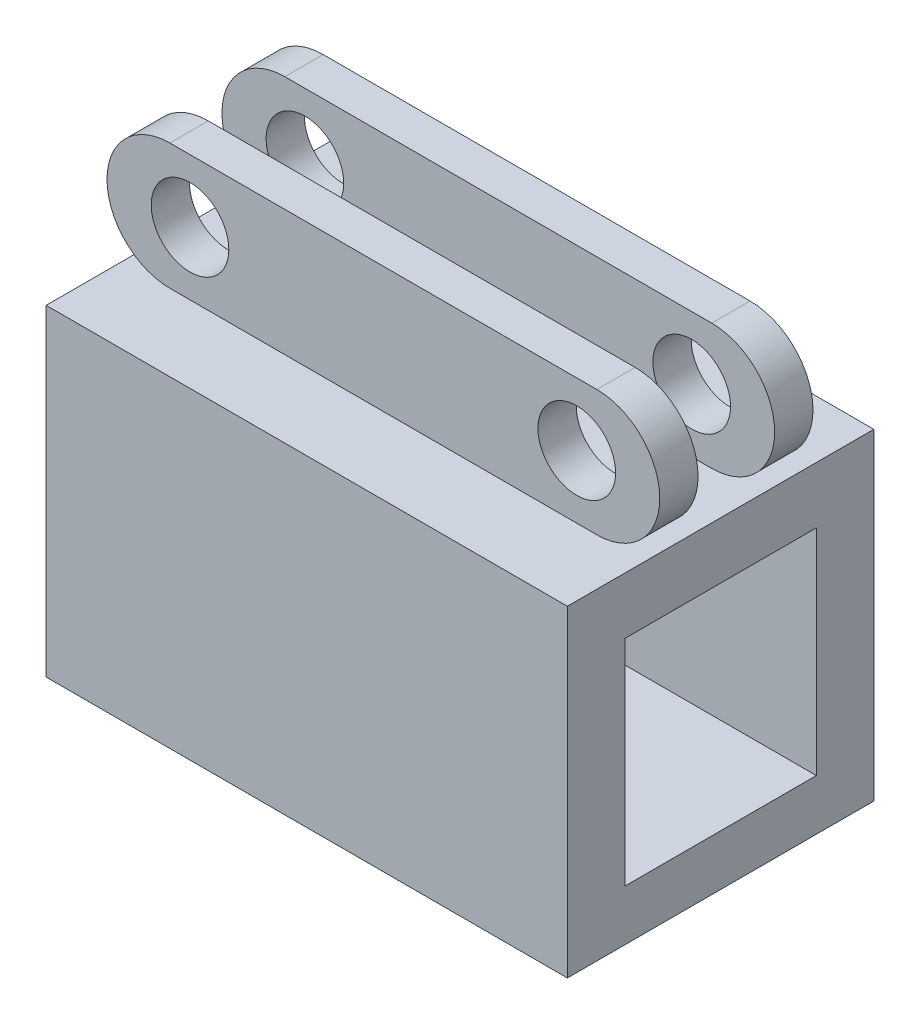
ISO-10303-21;
HEADER;
FILE_DESCRIPTION(('STEP AP214'),'2;1');
FILE_NAME('part.step','',(''),(''),'','','');
FILE_SCHEMA(('AUTOMOTIVE_DESIGN { 1 0 10303 214 1 1 1 1 }'));
ENDSEC;
DATA;
#1=APPLICATION_CONTEXT('core data for automotive mechanical design processes');
#2=APPLICATION_PROTOCOL_DEFINITION('international standard','automotive_design',2000,#1);
#3=PRODUCT_CONTEXT('',#1,'mechanical');
#4=PRODUCT('Part','Part','',(#3));
#5=PRODUCT_RELATED_PRODUCT_CATEGORY('part','',(#4));
#6=PRODUCT_DEFINITION_FORMATION('','',#4);
#7=PRODUCT_DEFINITION_CONTEXT('part definition',#1,'design');
#8=PRODUCT_DEFINITION('design','',#6,#7);
#9=PRODUCT_DEFINITION_SHAPE('','',#8);
#10=(LENGTH_UNIT() NAMED_UNIT(*) SI_UNIT(.MILLI.,.METRE.));
#11=(NAMED_UNIT(*) PLANE_ANGLE_UNIT() SI_UNIT($,.RADIAN.));
#12=(NAMED_UNIT(*) SI_UNIT($,.STERADIAN.) SOLID_ANGLE_UNIT());
#13=UNCERTAINTY_MEASURE_WITH_UNIT(LENGTH_MEASURE(1.E-05),#10,'distance_accuracy_value','');
#14=(GEOMETRIC_REPRESENTATION_CONTEXT(3) GLOBAL_UNCERTAINTY_ASSIGNED_CONTEXT((#13)) GLOBAL_UNIT_ASSIGNED_CONTEXT((#10,
#11,#12)) REPRESENTATION_CONTEXT('',''));
#15=CARTESIAN_POINT('',(0.,0.,0.));
#16=DIRECTION('',(0.,0.,1.));
#17=DIRECTION('',(1.,0.,0.));
#18=AXIS2_PLACEMENT_3D('',#15,#16,#17);
#19=CARTESIAN_POINT('',(-27.8600196417873,0.,10.));
#20=DIRECTION('',(0.,0.,-1.));
#21=DIRECTION('',(-1.,0.,0.));
#22=AXIS2_PLACEMENT_3D('',#19,#20,#21);
#23=CYLINDRICAL_SURFACE('',#22,8.21121810957072);
#24=CARTESIAN_POINT('',(-27.8600196417873,0.,5.));
#25=DIRECTION('',(0.,0.,-1.));
#26=DIRECTION('',(-1.,0.,0.));
#27=AXIS2_PLACEMENT_3D('',#24,#25,#26);
#28=CIRCLE('',#27,8.21121810957072);
#29=CARTESIAN_POINT('',(-27.8600196417873,-8.21121810957072,5.));
#30=VERTEX_POINT('',#29);
#31=CARTESIAN_POINT('',(-27.8600196417873,8.21121810957072,5.));
#32=VERTEX_POINT('',#31);
#33=EDGE_CURVE('E49',#30,#32,#28,.T.);
#34=ORIENTED_EDGE('',*,*,#33,.F.);
#35=DIRECTION('',(0.,0.,-1.));
#36=VECTOR('',#35,1.);
#37=CARTESIAN_POINT('',(-27.8600196417873,-8.21121810957072,10.));
#38=LINE('',#37,#36);
#39=CARTESIAN_POINT('',(-27.8600196417873,-8.21121810957072,10.));
#40=VERTEX_POINT('',#39);
#41=EDGE_CURVE('E160',#40,#30,#38,.T.);
#42=ORIENTED_EDGE('',*,*,#41,.F.);
#43=CARTESIAN_POINT('',(-27.8600196417873,0.,10.));
#44=DIRECTION('',(0.,0.,1.));
#45=DIRECTION('',(1.,0.,0.));
#46=AXIS2_PLACEMENT_3D('',#43,#44,#45);
#47=CIRCLE('',#46,8.21121810957072);
#48=CARTESIAN_POINT('',(-27.8600196417873,8.21121810957072,10.));
#49=VERTEX_POINT('',#48);
#50=EDGE_CURVE('E267',#49,#40,#47,.T.);
#51=ORIENTED_EDGE('',*,*,#50,.F.);
#52=DIRECTION('',(0.,0.,-1.));
#53=VECTOR('',#52,1.);
#54=CARTESIAN_POINT('',(-27.8600196417873,8.21121810957072,10.));
#55=LINE('',#54,#53);
#56=EDGE_CURVE('E163',#49,#32,#55,.T.);
#57=ORIENTED_EDGE('',*,*,#56,.T.);
#58=EDGE_LOOP('',(#34,#42,#51,#57));
#59=FACE_BOUND('',#58,.T.);
#60=ADVANCED_FACE('F32',(#59),#23,.T.);
#61=CARTESIAN_POINT('',(27.8600196417873,0.,10.));
#62=DIRECTION('',(0.,0.,-1.));
#63=DIRECTION('',(-1.,0.,0.));
#64=AXIS2_PLACEMENT_3D('',#61,#62,#63);
#65=CYLINDRICAL_SURFACE('',#64,8.21121810957072);
#66=CARTESIAN_POINT('',(27.8600196417873,0.,5.));
#67=DIRECTION('',(0.,0.,-1.));
#68=DIRECTION('',(-1.,0.,0.));
#69=AXIS2_PLACEMENT_3D('',#66,#67,#68);
#70=CIRCLE('',#69,8.21121810957072);
#71=CARTESIAN_POINT('',(27.8600196417873,8.21121810957072,5.));
#72=VERTEX_POINT('',#71);
#73=CARTESIAN_POINT('',(27.8600196417873,-8.21121810957072,5.));
#74=VERTEX_POINT('',#73);
#75=EDGE_CURVE('E149',#72,#74,#70,.T.);
#76=ORIENTED_EDGE('',*,*,#75,.F.);
#77=DIRECTION('',(0.,0.,-1.));
#78=VECTOR('',#77,1.);
#79=CARTESIAN_POINT('',(27.8600196417873,8.21121810957072,10.));
#80=LINE('',#79,#78);
#81=CARTESIAN_POINT('',(27.8600196417873,8.21121810957072,10.));
#82=VERTEX_POINT('',#81);
#83=EDGE_CURVE('E287',#82,#72,#80,.T.);
#84=ORIENTED_EDGE('',*,*,#83,.F.);
#85=CARTESIAN_POINT('',(27.8600196417873,0.,10.));
#86=DIRECTION('',(0.,0.,1.));
#87=DIRECTION('',(1.,0.,0.));
#88=AXIS2_PLACEMENT_3D('',#85,#86,#87);
#89=CIRCLE('',#88,8.21121810957072);
#90=CARTESIAN_POINT('',(27.8600196417873,-8.21121810957072,10.));
#91=VERTEX_POINT('',#90);
#92=EDGE_CURVE('E271',#91,#82,#89,.T.);
#93=ORIENTED_EDGE('',*,*,#92,.F.);
#94=DIRECTION('',(0.,0.,-1.));
#95=VECTOR('',#94,1.);
#96=CARTESIAN_POINT('',(27.8600196417873,-8.21121810957072,10.));
#97=LINE('',#96,#95);
#98=EDGE_CURVE('E174',#91,#74,#97,.T.);
#99=ORIENTED_EDGE('',*,*,#98,.T.);
#100=EDGE_LOOP('',(#76,#84,#93,#99));
#101=FACE_BOUND('',#100,.T.);
#102=ADVANCED_FACE('F324',(#101),#65,.T.);
#103=CARTESIAN_POINT('',(-27.8600196417873,8.21121810957072,10.));
#104=DIRECTION('',(0.,-1.,0.));
#105=DIRECTION('',(0.,0.,-1.));
#106=AXIS2_PLACEMENT_3D('',#103,#104,#105);
#107=PLANE('',#106);
#108=DIRECTION('',(1.,0.,0.));
#109=VECTOR('',#108,1.);
#110=CARTESIAN_POINT('',(-27.8600196417873,8.21121810957072,5.));
#111=LINE('',#110,#109);
#112=EDGE_CURVE('E195',#32,#72,#111,.T.);
#113=ORIENTED_EDGE('',*,*,#112,.F.);
#114=ORIENTED_EDGE('',*,*,#56,.F.);
#115=DIRECTION('',(-1.,0.,0.));
#116=VECTOR('',#115,1.);
#117=CARTESIAN_POINT('',(-27.8600196417873,8.21121810957072,10.));
#118=LINE('',#117,#116);
#119=EDGE_CURVE('E273',#82,#49,#118,.T.);
#120=ORIENTED_EDGE('',*,*,#119,.F.);
#121=ORIENTED_EDGE('',*,*,#83,.T.);
#122=EDGE_LOOP('',(#113,#114,#120,#121));
#123=FACE_BOUND('',#122,.T.);
#124=ADVANCED_FACE('F328',(#123),#107,.F.);
#125=CARTESIAN_POINT('',(-25.2410209957819,0.,-20.));
#126=DIRECTION('',(0.,0.,1.));
#127=DIRECTION('',(1.,0.,0.));
#128=AXIS2_PLACEMENT_3D('',#125,#126,#127);
#129=CYLINDRICAL_SURFACE('',#128,5.06710729723848);
#130=CARTESIAN_POINT('',(-25.2410209957819,0.,10.));
#131=DIRECTION('',(0.,0.,1.));
#132=DIRECTION('',(1.,0.,0.));
#133=AXIS2_PLACEMENT_3D('',#130,#131,#132);
#134=CIRCLE('',#133,5.06710729723848);
#135=CARTESIAN_POINT('',(-20.1739136985434,0.,10.));
#136=VERTEX_POINT('',#135);
#137=EDGE_CURVE('E185',#136,#136,#134,.T.);
#138=ORIENTED_EDGE('',*,*,#137,.T.);
#139=EDGE_LOOP('',(#138));
#140=FACE_BOUND('',#139,.T.);
#141=CARTESIAN_POINT('',(-25.2410209957819,0.,5.));
#142=DIRECTION('',(0.,0.,-1.));
#143=DIRECTION('',(-1.,0.,0.));
#144=AXIS2_PLACEMENT_3D('',#141,#142,#143);
#145=CIRCLE('',#144,5.06710729723848);
#146=CARTESIAN_POINT('',(-30.3081282930204,0.,5.));
#147=VERTEX_POINT('',#146);
#148=EDGE_CURVE('E191',#147,#147,#145,.F.);
#149=ORIENTED_EDGE('',*,*,#148,.F.);
#150=EDGE_LOOP('',(#149));
#151=FACE_BOUND('',#150,.T.);
#152=ADVANCED_FACE('F336',(#140,#151),#129,.F.);
#153=CARTESIAN_POINT('',(25.2410209957819,0.,-20.));
#154=DIRECTION('',(0.,0.,1.));
#155=DIRECTION('',(1.,0.,0.));
#156=AXIS2_PLACEMENT_3D('',#153,#154,#155);
#157=CYLINDRICAL_SURFACE('',#156,5.06710729723848);
#158=CARTESIAN_POINT('',(25.2410209957819,0.,10.));
#159=DIRECTION('',(0.,0.,1.));
#160=DIRECTION('',(-1.,0.,0.));
#161=AXIS2_PLACEMENT_3D('',#158,#159,#160);
#162=CIRCLE('',#161,5.06710729723848);
#163=CARTESIAN_POINT('',(20.1739136985434,0.,10.));
#164=VERTEX_POINT('',#163);
#165=EDGE_CURVE('E188',#164,#164,#162,.T.);
#166=ORIENTED_EDGE('',*,*,#165,.T.);
#167=EDGE_LOOP('',(#166));
#168=FACE_BOUND('',#167,.T.);
#169=CARTESIAN_POINT('',(25.2410209957819,0.,5.));
#170=DIRECTION('',(0.,0.,-1.));
#171=DIRECTION('',(-1.,0.,0.));
#172=AXIS2_PLACEMENT_3D('',#169,#170,#171);
#173=CIRCLE('',#172,5.06710729723848);
#174=CARTESIAN_POINT('',(20.1739136985434,0.,5.));
#175=VERTEX_POINT('',#174);
#176=EDGE_CURVE('E189',#175,#175,#173,.F.);
#177=ORIENTED_EDGE('',*,*,#176,.F.);
#178=EDGE_LOOP('',(#177));
#179=FACE_BOUND('',#178,.T.);
#180=ADVANCED_FACE('F331',(#168,#179),#157,.F.);
#181=CARTESIAN_POINT('',(-27.8600196417873,-8.21121810957072,-5.));
#182=VERTEX_POINT('',#181);
#183=CARTESIAN_POINT('',(-27.8600196417873,-8.21121810957072,-10.));
#184=VERTEX_POINT('',#183);
#185=EDGE_CURVE('E169',#182,#184,#38,.T.);
#186=ORIENTED_EDGE('',*,*,#185,.F.);
#187=CARTESIAN_POINT('',(-27.8600196417873,0.,-5.));
#188=DIRECTION('',(0.,0.,-1.));
#189=DIRECTION('',(-1.,0.,0.));
#190=AXIS2_PLACEMENT_3D('',#187,#188,#189);
#191=CIRCLE('',#190,8.21121810957072);
#192=CARTESIAN_POINT('',(-27.8600196417873,8.21121810957072,-5.));
#193=VERTEX_POINT('',#192);
#194=EDGE_CURVE('E212',#182,#193,#191,.T.);
#195=ORIENTED_EDGE('',*,*,#194,.T.);
#196=CARTESIAN_POINT('',(-27.8600196417873,8.21121810957072,-10.));
#197=VERTEX_POINT('',#196);
#198=EDGE_CURVE('E275',#193,#197,#55,.T.);
#199=ORIENTED_EDGE('',*,*,#198,.T.);
#200=CARTESIAN_POINT('',(-27.8600196417873,0.,-10.));
#201=DIRECTION('',(0.,0.,1.));
#202=DIRECTION('',(1.,0.,0.));
#203=AXIS2_PLACEMENT_3D('',#200,#201,#202);
#204=CIRCLE('',#203,8.21121810957072);
#205=EDGE_CURVE('E266',#197,#184,#204,.T.);
#206=ORIENTED_EDGE('',*,*,#205,.T.);
#207=EDGE_LOOP('',(#186,#195,#199,#206));
#208=FACE_BOUND('',#207,.T.);
#209=ADVANCED_FACE('F34',(#208),#23,.T.);
#210=CARTESIAN_POINT('',(27.8600196417873,8.21121810957072,-5.));
#211=VERTEX_POINT('',#210);
#212=CARTESIAN_POINT('',(27.8600196417873,8.21121810957072,-10.));
#213=VERTEX_POINT('',#212);
#214=EDGE_CURVE('E286',#211,#213,#80,.T.);
#215=ORIENTED_EDGE('',*,*,#214,.F.);
#216=CARTESIAN_POINT('',(27.8600196417873,0.,-5.));
#217=DIRECTION('',(0.,0.,-1.));
#218=DIRECTION('',(-1.,0.,0.));
#219=AXIS2_PLACEMENT_3D('',#216,#217,#218);
#220=CIRCLE('',#219,8.21121810957072);
#221=CARTESIAN_POINT('',(27.8600196417873,-8.21121810957072,-5.));
#222=VERTEX_POINT('',#221);
#223=EDGE_CURVE('E210',#211,#222,#220,.T.);
#224=ORIENTED_EDGE('',*,*,#223,.T.);
#225=CARTESIAN_POINT('',(27.8600196417873,-8.21121810957072,-10.));
#226=VERTEX_POINT('',#225);
#227=EDGE_CURVE('E289',#222,#226,#97,.T.);
#228=ORIENTED_EDGE('',*,*,#227,.T.);
#229=CARTESIAN_POINT('',(27.8600196417873,0.,-10.));
#230=DIRECTION('',(0.,0.,1.));
#231=DIRECTION('',(1.,0.,0.));
#232=AXIS2_PLACEMENT_3D('',#229,#230,#231);
#233=CIRCLE('',#232,8.21121810957072);
#234=EDGE_CURVE('E281',#226,#213,#233,.T.);
#235=ORIENTED_EDGE('',*,*,#234,.T.);
#236=EDGE_LOOP('',(#215,#224,#228,#235));
#237=FACE_BOUND('',#236,.T.);
#238=ADVANCED_FACE('F301',(#237),#65,.T.);
#239=ORIENTED_EDGE('',*,*,#198,.F.);
#240=DIRECTION('',(1.,0.,0.));
#241=VECTOR('',#240,1.);
#242=CARTESIAN_POINT('',(-27.8600196417873,8.21121810957072,-5.));
#243=LINE('',#242,#241);
#244=EDGE_CURVE('E207',#193,#211,#243,.T.);
#245=ORIENTED_EDGE('',*,*,#244,.T.);
#246=ORIENTED_EDGE('',*,*,#214,.T.);
#247=DIRECTION('',(-1.,0.,0.));
#248=VECTOR('',#247,1.);
#249=CARTESIAN_POINT('',(-27.8600196417873,8.21121810957072,-10.));
#250=LINE('',#249,#248);
#251=EDGE_CURVE('E269',#213,#197,#250,.T.);
#252=ORIENTED_EDGE('',*,*,#251,.T.);
#253=EDGE_LOOP('',(#239,#245,#246,#252));
#254=FACE_BOUND('',#253,.T.);
#255=ADVANCED_FACE('F296',(#254),#107,.F.);
#256=CARTESIAN_POINT('',(-27.8600196417873,0.,10.));
#257=DIRECTION('',(0.,0.,1.));
#258=DIRECTION('',(1.,0.,0.));
#259=AXIS2_PLACEMENT_3D('',#256,#257,#258);
#260=PLANE('',#259);
#261=ORIENTED_EDGE('',*,*,#165,.F.);
#262=EDGE_LOOP('',(#261));
#263=FACE_BOUND('',#262,.T.);
#264=ORIENTED_EDGE('',*,*,#137,.F.);
#265=EDGE_LOOP('',(#264));
#266=FACE_BOUND('',#265,.T.);
#267=ORIENTED_EDGE('',*,*,#50,.T.);
#268=DIRECTION('',(1.,0.,0.));
#269=VECTOR('',#268,1.);
#270=CARTESIAN_POINT('',(-27.8600196417873,-8.21121810957072,10.));
#271=LINE('',#270,#269);
#272=EDGE_CURVE('E167',#40,#91,#271,.T.);
#273=ORIENTED_EDGE('',*,*,#272,.T.);
#274=ORIENTED_EDGE('',*,*,#92,.T.);
#275=ORIENTED_EDGE('',*,*,#119,.T.);
#276=EDGE_LOOP('',(#267,#273,#274,#275));
#277=FACE_BOUND('',#276,.T.);
#278=ADVANCED_FACE('F365',(#263,#266,#277),#260,.T.);
#279=CARTESIAN_POINT('',(-27.8600196417873,0.,-10.));
#280=DIRECTION('',(0.,0.,1.));
#281=DIRECTION('',(1.,0.,0.));
#282=AXIS2_PLACEMENT_3D('',#279,#280,#281);
#283=PLANE('',#282);
#284=CARTESIAN_POINT('',(25.2410209957819,0.,-10.));
#285=DIRECTION('',(0.,0.,1.));
#286=DIRECTION('',(1.,0.,0.));
#287=AXIS2_PLACEMENT_3D('',#284,#285,#286);
#288=CIRCLE('',#287,5.06710729723848);
#289=CARTESIAN_POINT('',(30.3081282930204,0.,-10.));
#290=VERTEX_POINT('',#289);
#291=EDGE_CURVE('E186',#290,#290,#288,.T.);
#292=ORIENTED_EDGE('',*,*,#291,.T.);
#293=EDGE_LOOP('',(#292));
#294=FACE_BOUND('',#293,.T.);
#295=CARTESIAN_POINT('',(-25.2410209957819,0.,-10.));
#296=DIRECTION('',(0.,0.,1.));
#297=DIRECTION('',(1.,0.,0.));
#298=AXIS2_PLACEMENT_3D('',#295,#296,#297);
#299=CIRCLE('',#298,5.06710729723848);
#300=CARTESIAN_POINT('',(-20.1739136985434,0.,-10.));
#301=VERTEX_POINT('',#300);
#302=EDGE_CURVE('E182',#301,#301,#299,.T.);
#303=ORIENTED_EDGE('',*,*,#302,.T.);
#304=EDGE_LOOP('',(#303));
#305=FACE_BOUND('',#304,.T.);
#306=ORIENTED_EDGE('',*,*,#205,.F.);
#307=ORIENTED_EDGE('',*,*,#251,.F.);
#308=ORIENTED_EDGE('',*,*,#234,.F.);
#309=DIRECTION('',(1.,0.,0.));
#310=VECTOR('',#309,1.);
#311=CARTESIAN_POINT('',(-27.8600196417873,-8.21121810957072,-10.));
#312=LINE('',#311,#310);
#313=EDGE_CURVE('E278',#184,#226,#312,.T.);
#314=ORIENTED_EDGE('',*,*,#313,.F.);
#315=EDGE_LOOP('',(#306,#307,#308,#314));
#316=FACE_BOUND('',#315,.T.);
#317=ADVANCED_FACE('F305',(#294,#305,#316),#283,.F.);
#318=CARTESIAN_POINT('',(34.0133718647317,-8.21121810957072,20.));
#319=DIRECTION('',(-1.,0.,0.));
#320=DIRECTION('',(0.,0.,1.));
#321=AXIS2_PLACEMENT_3D('',#318,#319,#320);
#322=PLANE('',#321);
#323=DIRECTION('',(0.,0.,1.));
#324=VECTOR('',#323,1.);
#325=CARTESIAN_POINT('',(34.0133718647317,-15.5986283572491,-12.5));
#326=LINE('',#325,#324);
#327=CARTESIAN_POINT('',(34.0133718647317,-15.5986283572491,-12.5));
#328=VERTEX_POINT('',#327);
#329=CARTESIAN_POINT('',(34.0133718647317,-15.5986283572491,12.5));
#330=VERTEX_POINT('',#329);
#331=EDGE_CURVE('E220',#328,#330,#326,.T.);
#332=ORIENTED_EDGE('',*,*,#331,.F.);
#333=DIRECTION('',(0.,1.,0.));
#334=VECTOR('',#333,1.);
#335=CARTESIAN_POINT('',(34.0133718647317,-15.5986283572491,-12.5));
#336=LINE('',#335,#334);
#337=CARTESIAN_POINT('',(34.0133718647318,-43.5986283572491,-12.5));
#338=VERTEX_POINT('',#337);
#339=EDGE_CURVE('E57',#338,#328,#336,.T.);
#340=ORIENTED_EDGE('',*,*,#339,.F.);
#341=DIRECTION('',(0.,0.,-1.));
#342=VECTOR('',#341,1.);
#343=CARTESIAN_POINT('',(34.0133718647318,-43.5986283572491,-12.5));
#344=LINE('',#343,#342);
#345=CARTESIAN_POINT('',(34.0133718647318,-43.5986283572491,12.5));
#346=VERTEX_POINT('',#345);
#347=EDGE_CURVE('E226',#346,#338,#344,.T.);
#348=ORIENTED_EDGE('',*,*,#347,.F.);
#349=DIRECTION('',(0.,-1.,0.));
#350=VECTOR('',#349,1.);
#351=CARTESIAN_POINT('',(34.0133718647317,-15.5986283572491,12.5));
#352=LINE('',#351,#350);
#353=EDGE_CURVE('E223',#330,#346,#352,.T.);
#354=ORIENTED_EDGE('',*,*,#353,.F.);
#355=EDGE_LOOP('',(#332,#340,#348,#354));
#356=FACE_BOUND('',#355,.T.);
#357=DIRECTION('',(0.,1.,0.));
#358=VECTOR('',#357,1.);
#359=CARTESIAN_POINT('',(34.0133718647317,-8.21121810957072,-20.));
#360=LINE('',#359,#358);
#361=CARTESIAN_POINT('',(34.0133718647317,-50.2338086371809,-20.));
#362=VERTEX_POINT('',#361);
#363=CARTESIAN_POINT('',(34.0133718647317,-8.21121810957072,-20.));
#364=VERTEX_POINT('',#363);
#365=EDGE_CURVE('E232',#362,#364,#360,.T.);
#366=ORIENTED_EDGE('',*,*,#365,.T.);
#367=DIRECTION('',(0.,0.,-1.));
#368=VECTOR('',#367,1.);
#369=CARTESIAN_POINT('',(34.0133718647317,-8.21121810957072,20.));
#370=LINE('',#369,#368);
#371=CARTESIAN_POINT('',(34.0133718647317,-8.21121810957072,20.));
#372=VERTEX_POINT('',#371);
#373=EDGE_CURVE('E264',#372,#364,#370,.T.);
#374=ORIENTED_EDGE('',*,*,#373,.F.);
#375=DIRECTION('',(0.,1.,0.));
#376=VECTOR('',#375,1.);
#377=CARTESIAN_POINT('',(34.0133718647317,-8.21121810957072,20.));
#378=LINE('',#377,#376);
#379=CARTESIAN_POINT('',(34.0133718647317,-50.2338086371809,20.));
#380=VERTEX_POINT('',#379);
#381=EDGE_CURVE('E238',#380,#372,#378,.T.);
#382=ORIENTED_EDGE('',*,*,#381,.F.);
#383=DIRECTION('',(0.,0.,-1.));
#384=VECTOR('',#383,1.);
#385=CARTESIAN_POINT('',(34.0133718647317,-50.2338086371809,20.));
#386=LINE('',#385,#384);
#387=EDGE_CURVE('E248',#380,#362,#386,.T.);
#388=ORIENTED_EDGE('',*,*,#387,.T.);
#389=EDGE_LOOP('',(#366,#374,#382,#388));
#390=FACE_BOUND('',#389,.T.);
#391=ADVANCED_FACE('F312',(#356,#390),#322,.F.);
#392=CARTESIAN_POINT('',(34.0133718647317,-8.21121810957072,20.));
#393=DIRECTION('',(0.,-1.,0.));
#394=DIRECTION('',(0.,0.,-1.));
#395=AXIS2_PLACEMENT_3D('',#392,#393,#394);
#396=PLANE('',#395);
#397=DIRECTION('',(1.,0.,0.));
#398=VECTOR('',#397,1.);
#399=CARTESIAN_POINT('',(-82.5484759316371,-8.21121810957072,-5.));
#400=LINE('',#399,#398);
#401=EDGE_CURVE('E154',#182,#222,#400,.T.);
#402=ORIENTED_EDGE('',*,*,#401,.F.);
#403=ORIENTED_EDGE('',*,*,#185,.T.);
#404=ORIENTED_EDGE('',*,*,#313,.T.);
#405=ORIENTED_EDGE('',*,*,#227,.F.);
#406=EDGE_LOOP('',(#402,#403,#404,#405));
#407=FACE_BOUND('',#406,.T.);
#408=ORIENTED_EDGE('',*,*,#41,.T.);
#409=DIRECTION('',(1.,0.,0.));
#410=VECTOR('',#409,1.);
#411=CARTESIAN_POINT('',(-82.5484759316371,-8.21121810957072,5.));
#412=LINE('',#411,#410);
#413=EDGE_CURVE('E146',#30,#74,#412,.T.);
#414=ORIENTED_EDGE('',*,*,#413,.T.);
#415=ORIENTED_EDGE('',*,*,#98,.F.);
#416=ORIENTED_EDGE('',*,*,#272,.F.);
#417=EDGE_LOOP('',(#408,#414,#415,#416));
#418=FACE_BOUND('',#417,.T.);
#419=DIRECTION('',(-1.,0.,0.));
#420=VECTOR('',#419,1.);
#421=CARTESIAN_POINT('',(34.0133718647317,-8.21121810957072,-20.));
#422=LINE('',#421,#420);
#423=CARTESIAN_POINT('',(-34.0133718647317,-8.21121810957072,-20.));
#424=VERTEX_POINT('',#423);
#425=EDGE_CURVE('E251',#364,#424,#422,.T.);
#426=ORIENTED_EDGE('',*,*,#425,.T.);
#427=DIRECTION('',(0.,0.,-1.));
#428=VECTOR('',#427,1.);
#429=CARTESIAN_POINT('',(-34.0133718647317,-8.21121810957072,20.));
#430=LINE('',#429,#428);
#431=CARTESIAN_POINT('',(-34.0133718647317,-8.21121810957072,20.));
#432=VERTEX_POINT('',#431);
#433=EDGE_CURVE('E262',#432,#424,#430,.T.);
#434=ORIENTED_EDGE('',*,*,#433,.F.);
#435=DIRECTION('',(-1.,0.,0.));
#436=VECTOR('',#435,1.);
#437=CARTESIAN_POINT('',(34.0133718647317,-8.21121810957072,20.));
#438=LINE('',#437,#436);
#439=EDGE_CURVE('E241',#372,#432,#438,.T.);
#440=ORIENTED_EDGE('',*,*,#439,.F.);
#441=ORIENTED_EDGE('',*,*,#373,.T.);
#442=EDGE_LOOP('',(#426,#434,#440,#441));
#443=FACE_BOUND('',#442,.T.);
#444=ADVANCED_FACE('F165',(#407,#418,#443),#396,.F.);
#445=CARTESIAN_POINT('',(-34.0133718647317,-8.21121810957072,20.));
#446=DIRECTION('',(1.,0.,0.));
#447=DIRECTION('',(0.,0.,-1.));
#448=AXIS2_PLACEMENT_3D('',#445,#446,#447);
#449=PLANE('',#448);
#450=DIRECTION('',(0.,0.,-1.));
#451=VECTOR('',#450,1.);
#452=CARTESIAN_POINT('',(-34.0133718647317,-43.5986283572492,20.));
#453=LINE('',#452,#451);
#454=CARTESIAN_POINT('',(-34.0133718647317,-43.5986283572492,12.5));
#455=VERTEX_POINT('',#454);
#456=CARTESIAN_POINT('',(-34.0133718647317,-43.5986283572492,-12.5));
#457=VERTEX_POINT('',#456);
#458=EDGE_CURVE('E41',#455,#457,#453,.T.);
#459=ORIENTED_EDGE('',*,*,#458,.T.);
#460=DIRECTION('',(0.,1.,0.));
#461=VECTOR('',#460,1.);
#462=CARTESIAN_POINT('',(-34.0133718647317,-8.21121810957072,-12.5));
#463=LINE('',#462,#461);
#464=CARTESIAN_POINT('',(-34.0133718647317,-15.5986283572492,-12.5));
#465=VERTEX_POINT('',#464);
#466=EDGE_CURVE('E11',#457,#465,#463,.T.);
#467=ORIENTED_EDGE('',*,*,#466,.T.);
#468=DIRECTION('',(0.,0.,1.));
#469=VECTOR('',#468,1.);
#470=CARTESIAN_POINT('',(-34.0133718647317,-15.5986283572492,20.));
#471=LINE('',#470,#469);
#472=CARTESIAN_POINT('',(-34.0133718647317,-15.5986283572492,12.5));
#473=VERTEX_POINT('',#472);
#474=EDGE_CURVE('E168',#465,#473,#471,.T.);
#475=ORIENTED_EDGE('',*,*,#474,.T.);
#476=DIRECTION('',(0.,-1.,0.));
#477=VECTOR('',#476,1.);
#478=CARTESIAN_POINT('',(-34.0133718647317,-8.21121810957071,12.5));
#479=LINE('',#478,#477);
#480=EDGE_CURVE('E172',#473,#455,#479,.T.);
#481=ORIENTED_EDGE('',*,*,#480,.T.);
#482=EDGE_LOOP('',(#459,#467,#475,#481));
#483=FACE_BOUND('',#482,.T.);
#484=DIRECTION('',(0.,-1.,0.));
#485=VECTOR('',#484,1.);
#486=CARTESIAN_POINT('',(-34.0133718647317,-8.21121810957072,-20.));
#487=LINE('',#486,#485);
#488=CARTESIAN_POINT('',(-34.0133718647317,-50.2338086371809,-20.));
#489=VERTEX_POINT('',#488);
#490=EDGE_CURVE('E254',#424,#489,#487,.T.);
#491=ORIENTED_EDGE('',*,*,#490,.T.);
#492=DIRECTION('',(0.,0.,-1.));
#493=VECTOR('',#492,1.);
#494=CARTESIAN_POINT('',(-34.0133718647317,-50.2338086371809,20.));
#495=LINE('',#494,#493);
#496=CARTESIAN_POINT('',(-34.0133718647317,-50.2338086371809,20.));
#497=VERTEX_POINT('',#496);
#498=EDGE_CURVE('E259',#497,#489,#495,.T.);
#499=ORIENTED_EDGE('',*,*,#498,.F.);
#500=DIRECTION('',(0.,-1.,0.));
#501=VECTOR('',#500,1.);
#502=CARTESIAN_POINT('',(-34.0133718647317,-8.21121810957072,20.));
#503=LINE('',#502,#501);
#504=EDGE_CURVE('E244',#432,#497,#503,.T.);
#505=ORIENTED_EDGE('',*,*,#504,.F.);
#506=ORIENTED_EDGE('',*,*,#433,.T.);
#507=EDGE_LOOP('',(#491,#499,#505,#506));
#508=FACE_BOUND('',#507,.T.);
#509=ADVANCED_FACE('F311',(#483,#508),#449,.F.);
#510=CARTESIAN_POINT('',(34.0133718647317,-50.2338086371809,20.));
#511=DIRECTION('',(0.,1.,0.));
#512=DIRECTION('',(0.,0.,1.));
#513=AXIS2_PLACEMENT_3D('',#510,#511,#512);
#514=PLANE('',#513);
#515=DIRECTION('',(1.,0.,0.));
#516=VECTOR('',#515,1.);
#517=CARTESIAN_POINT('',(34.0133718647317,-50.2338086371809,-20.));
#518=LINE('',#517,#516);
#519=EDGE_CURVE('E242',#489,#362,#518,.T.);
#520=ORIENTED_EDGE('',*,*,#519,.T.);
#521=ORIENTED_EDGE('',*,*,#387,.F.);
#522=DIRECTION('',(1.,0.,0.));
#523=VECTOR('',#522,1.);
#524=CARTESIAN_POINT('',(34.0133718647317,-50.2338086371809,20.));
#525=LINE('',#524,#523);
#526=EDGE_CURVE('E246',#497,#380,#525,.T.);
#527=ORIENTED_EDGE('',*,*,#526,.F.);
#528=ORIENTED_EDGE('',*,*,#498,.T.);
#529=EDGE_LOOP('',(#520,#521,#527,#528));
#530=FACE_BOUND('',#529,.T.);
#531=ADVANCED_FACE('F318',(#530),#514,.F.);
#532=CARTESIAN_POINT('',(0.,0.,20.));
#533=DIRECTION('',(0.,0.,-1.));
#534=DIRECTION('',(-1.,0.,0.));
#535=AXIS2_PLACEMENT_3D('',#532,#533,#534);
#536=PLANE('',#535);
#537=ORIENTED_EDGE('',*,*,#381,.T.);
#538=ORIENTED_EDGE('',*,*,#439,.T.);
#539=ORIENTED_EDGE('',*,*,#504,.T.);
#540=ORIENTED_EDGE('',*,*,#526,.T.);
#541=EDGE_LOOP('',(#537,#538,#539,#540));
#542=FACE_BOUND('',#541,.T.);
#543=ADVANCED_FACE('F495',(#542),#536,.F.);
#544=CARTESIAN_POINT('',(0.,0.,-20.));
#545=DIRECTION('',(0.,0.,-1.));
#546=DIRECTION('',(-1.,0.,0.));
#547=AXIS2_PLACEMENT_3D('',#544,#545,#546);
#548=PLANE('',#547);
#549=ORIENTED_EDGE('',*,*,#365,.F.);
#550=ORIENTED_EDGE('',*,*,#519,.F.);
#551=ORIENTED_EDGE('',*,*,#490,.F.);
#552=ORIENTED_EDGE('',*,*,#425,.F.);
#553=EDGE_LOOP('',(#549,#550,#551,#552));
#554=FACE_BOUND('',#553,.T.);
#555=ADVANCED_FACE('F488',(#554),#548,.T.);
#556=CARTESIAN_POINT('',(-36.071237751358,-15.5986283572492,-12.5));
#557=DIRECTION('',(0.,0.,-1.));
#558=DIRECTION('',(0.,1.,0.));
#559=AXIS2_PLACEMENT_3D('',#556,#557,#558);
#560=PLANE('',#559);
#561=DIRECTION('',(1.,0.,0.));
#562=VECTOR('',#561,1.);
#563=CARTESIAN_POINT('',(-36.071237751358,-43.5986283572492,-12.5));
#564=LINE('',#563,#562);
#565=EDGE_CURVE('E230',#457,#338,#564,.T.);
#566=ORIENTED_EDGE('',*,*,#565,.T.);
#567=ORIENTED_EDGE('',*,*,#339,.T.);
#568=DIRECTION('',(1.,0.,0.));
#569=VECTOR('',#568,1.);
#570=CARTESIAN_POINT('',(-36.071237751358,-15.5986283572492,-12.5));
#571=LINE('',#570,#569);
#572=EDGE_CURVE('E229',#465,#328,#571,.T.);
#573=ORIENTED_EDGE('',*,*,#572,.F.);
#574=ORIENTED_EDGE('',*,*,#466,.F.);
#575=EDGE_LOOP('',(#566,#567,#573,#574));
#576=FACE_BOUND('',#575,.T.);
#577=ADVANCED_FACE('F480',(#576),#560,.F.);
#578=CARTESIAN_POINT('',(-36.071237751358,-43.5986283572492,-12.5));
#579=DIRECTION('',(0.,-1.,0.));
#580=DIRECTION('',(1.,0.,0.));
#581=AXIS2_PLACEMENT_3D('',#578,#579,#580);
#582=PLANE('',#581);
#583=DIRECTION('',(1.,0.,0.));
#584=VECTOR('',#583,1.);
#585=CARTESIAN_POINT('',(-36.071237751358,-43.5986283572492,12.5));
#586=LINE('',#585,#584);
#587=EDGE_CURVE('E233',#455,#346,#586,.T.);
#588=ORIENTED_EDGE('',*,*,#587,.T.);
#589=ORIENTED_EDGE('',*,*,#347,.T.);
#590=ORIENTED_EDGE('',*,*,#565,.F.);
#591=ORIENTED_EDGE('',*,*,#458,.F.);
#592=EDGE_LOOP('',(#588,#589,#590,#591));
#593=FACE_BOUND('',#592,.T.);
#594=ADVANCED_FACE('F472',(#593),#582,.F.);
#595=CARTESIAN_POINT('',(-36.071237751358,-15.5986283572492,12.5));
#596=DIRECTION('',(0.,0.,1.));
#597=DIRECTION('',(0.,-1.,0.));
#598=AXIS2_PLACEMENT_3D('',#595,#596,#597);
#599=PLANE('',#598);
#600=DIRECTION('',(1.,0.,0.));
#601=VECTOR('',#600,1.);
#602=CARTESIAN_POINT('',(-36.071237751358,-15.5986283572492,12.5));
#603=LINE('',#602,#601);
#604=EDGE_CURVE('E235',#473,#330,#603,.T.);
#605=ORIENTED_EDGE('',*,*,#604,.T.);
#606=ORIENTED_EDGE('',*,*,#353,.T.);
#607=ORIENTED_EDGE('',*,*,#587,.F.);
#608=ORIENTED_EDGE('',*,*,#480,.F.);
#609=EDGE_LOOP('',(#605,#606,#607,#608));
#610=FACE_BOUND('',#609,.T.);
#611=ADVANCED_FACE('F464',(#610),#599,.F.);
#612=CARTESIAN_POINT('',(-36.071237751358,-15.5986283572492,-12.5));
#613=DIRECTION('',(0.,1.,0.));
#614=DIRECTION('',(-1.,0.,0.));
#615=AXIS2_PLACEMENT_3D('',#612,#613,#614);
#616=PLANE('',#615);
#617=ORIENTED_EDGE('',*,*,#572,.T.);
#618=ORIENTED_EDGE('',*,*,#331,.T.);
#619=ORIENTED_EDGE('',*,*,#604,.F.);
#620=ORIENTED_EDGE('',*,*,#474,.F.);
#621=EDGE_LOOP('',(#617,#618,#619,#620));
#622=FACE_BOUND('',#621,.T.);
#623=ADVANCED_FACE('F356',(#622),#616,.F.);
#624=CARTESIAN_POINT('',(-25.2410209957819,0.,-5.));
#625=DIRECTION('',(0.,0.,-1.));
#626=DIRECTION('',(-1.,0.,0.));
#627=AXIS2_PLACEMENT_3D('',#624,#625,#626);
#628=CIRCLE('',#627,5.06710729723848);
#629=CARTESIAN_POINT('',(-30.3081282930204,0.,-5.));
#630=VERTEX_POINT('',#629);
#631=EDGE_CURVE('E204',#630,#630,#628,.F.);
#632=ORIENTED_EDGE('',*,*,#631,.T.);
#633=EDGE_LOOP('',(#632));
#634=FACE_BOUND('',#633,.T.);
#635=ORIENTED_EDGE('',*,*,#302,.F.);
#636=EDGE_LOOP('',(#635));
#637=FACE_BOUND('',#636,.T.);
#638=ADVANCED_FACE('F345',(#634,#637),#129,.F.);
#639=CARTESIAN_POINT('',(25.2410209957819,0.,-5.));
#640=DIRECTION('',(0.,0.,-1.));
#641=DIRECTION('',(-1.,0.,0.));
#642=AXIS2_PLACEMENT_3D('',#639,#640,#641);
#643=CIRCLE('',#642,5.06710729723848);
#644=CARTESIAN_POINT('',(20.1739136985434,0.,-5.));
#645=VERTEX_POINT('',#644);
#646=EDGE_CURVE('E36',#645,#645,#643,.F.);
#647=ORIENTED_EDGE('',*,*,#646,.T.);
#648=EDGE_LOOP('',(#647));
#649=FACE_BOUND('',#648,.T.);
#650=ORIENTED_EDGE('',*,*,#291,.F.);
#651=EDGE_LOOP('',(#650));
#652=FACE_BOUND('',#651,.T.);
#653=ADVANCED_FACE('F339',(#649,#652),#157,.F.);
#654=CARTESIAN_POINT('',(0.,0.,-5.));
#655=DIRECTION('',(0.,0.,-1.));
#656=DIRECTION('',(-1.,0.,0.));
#657=AXIS2_PLACEMENT_3D('',#654,#655,#656);
#658=PLANE('',#657);
#659=ORIENTED_EDGE('',*,*,#646,.F.);
#660=EDGE_LOOP('',(#659));
#661=FACE_BOUND('',#660,.T.);
#662=ORIENTED_EDGE('',*,*,#631,.F.);
#663=EDGE_LOOP('',(#662));
#664=FACE_BOUND('',#663,.T.);
#665=ORIENTED_EDGE('',*,*,#401,.T.);
#666=ORIENTED_EDGE('',*,*,#223,.F.);
#667=ORIENTED_EDGE('',*,*,#244,.F.);
#668=ORIENTED_EDGE('',*,*,#194,.F.);
#669=EDGE_LOOP('',(#665,#666,#667,#668));
#670=FACE_BOUND('',#669,.T.);
#671=ADVANCED_FACE('F308',(#661,#664,#670),#658,.F.);
#672=CARTESIAN_POINT('',(0.,0.,5.));
#673=DIRECTION('',(0.,0.,-1.));
#674=DIRECTION('',(-1.,0.,0.));
#675=AXIS2_PLACEMENT_3D('',#672,#673,#674);
#676=PLANE('',#675);
#677=ORIENTED_EDGE('',*,*,#148,.T.);
#678=EDGE_LOOP('',(#677));
#679=FACE_BOUND('',#678,.T.);
#680=ORIENTED_EDGE('',*,*,#176,.T.);
#681=EDGE_LOOP('',(#680));
#682=FACE_BOUND('',#681,.T.);
#683=ORIENTED_EDGE('',*,*,#33,.T.);
#684=ORIENTED_EDGE('',*,*,#112,.T.);
#685=ORIENTED_EDGE('',*,*,#75,.T.);
#686=ORIENTED_EDGE('',*,*,#413,.F.);
#687=EDGE_LOOP('',(#683,#684,#685,#686));
#688=FACE_BOUND('',#687,.T.);
#689=ADVANCED_FACE('F147',(#679,#682,#688),#676,.T.);
#690=CLOSED_SHELL('',(#60,#102,#124,#152,#180,#209,#238,#255,#278,#317,#391,#444,#509,#531,#543,
#555,#577,#594,#611,#623,#638,#653,#671,#689));
#691=MANIFOLD_SOLID_BREP('B2',#690);
#692=ADVANCED_BREP_SHAPE_REPRESENTATION('',(#18,#691),#14);
#693=SHAPE_DEFINITION_REPRESENTATION(#9,#692);
ENDSEC;
END-ISO-10303-21;
